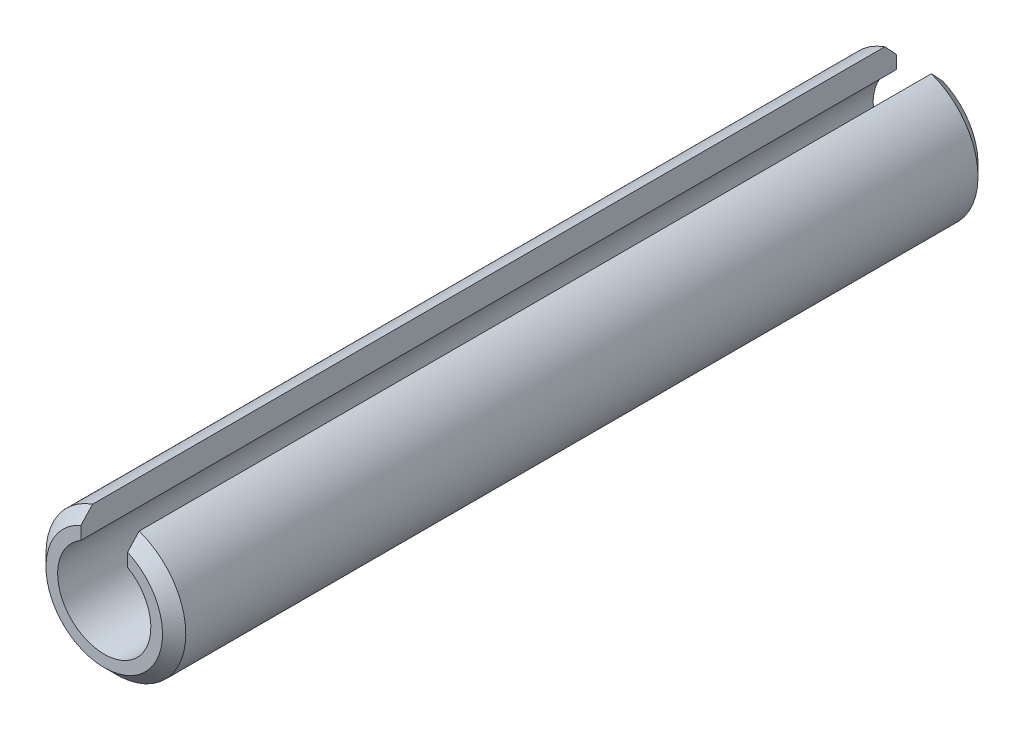
ISO-10303-21;
HEADER;
FILE_DESCRIPTION(('STEP AP214'),'2;1');
FILE_NAME('part.step','',(''),(''),'','','');
FILE_SCHEMA(('AUTOMOTIVE_DESIGN { 1 0 10303 214 1 1 1 1 }'));
ENDSEC;
DATA;
#1=APPLICATION_CONTEXT('core data for automotive mechanical design processes');
#2=APPLICATION_PROTOCOL_DEFINITION('international standard','automotive_design',2000,#1);
#3=PRODUCT_CONTEXT('',#1,'mechanical');
#4=PRODUCT('Part','Part','',(#3));
#5=PRODUCT_RELATED_PRODUCT_CATEGORY('part','',(#4));
#6=PRODUCT_DEFINITION_FORMATION('','',#4);
#7=PRODUCT_DEFINITION_CONTEXT('part definition',#1,'design');
#8=PRODUCT_DEFINITION('design','',#6,#7);
#9=PRODUCT_DEFINITION_SHAPE('','',#8);
#10=(LENGTH_UNIT() NAMED_UNIT(*) SI_UNIT(.MILLI.,.METRE.));
#11=(NAMED_UNIT(*) PLANE_ANGLE_UNIT() SI_UNIT($,.RADIAN.));
#12=(NAMED_UNIT(*) SI_UNIT($,.STERADIAN.) SOLID_ANGLE_UNIT());
#13=UNCERTAINTY_MEASURE_WITH_UNIT(LENGTH_MEASURE(1.E-05),#10,'distance_accuracy_value','');
#14=(GEOMETRIC_REPRESENTATION_CONTEXT(3) GLOBAL_UNCERTAINTY_ASSIGNED_CONTEXT((#13)) GLOBAL_UNIT_ASSIGNED_CONTEXT((#10,
#11,#12)) REPRESENTATION_CONTEXT('',''));
#15=CARTESIAN_POINT('',(0.,0.,0.));
#16=DIRECTION('',(0.,0.,1.));
#17=DIRECTION('',(1.,0.,0.));
#18=AXIS2_PLACEMENT_3D('',#15,#16,#17);
#19=CARTESIAN_POINT('',(0.,0.,35.));
#20=DIRECTION('',(0.,0.,-1.));
#21=DIRECTION('',(-1.,0.,0.));
#22=AXIS2_PLACEMENT_3D('',#19,#20,#21);
#23=CYLINDRICAL_SURFACE('',#22,3.);
#24=DIRECTION('',(0.,0.,-1.));
#25=VECTOR('',#24,1.);
#26=CARTESIAN_POINT('',(-0.999999999999997,2.82842712474619,35.));
#27=LINE('',#26,#25);
#28=CARTESIAN_POINT('',(-0.999999999999997,2.82842712474619,34.5));
#29=VERTEX_POINT('',#28);
#30=CARTESIAN_POINT('',(-0.999999999999997,2.82842712474619,0.5));
#31=VERTEX_POINT('',#30);
#32=EDGE_CURVE('E114',#29,#31,#27,.T.);
#33=ORIENTED_EDGE('',*,*,#32,.T.);
#34=CARTESIAN_POINT('',(0.,0.,0.5));
#35=DIRECTION('',(0.,0.,1.));
#36=DIRECTION('',(1.,0.,0.));
#37=AXIS2_PLACEMENT_3D('',#34,#35,#36);
#38=CIRCLE('',#37,3.);
#39=CARTESIAN_POINT('',(1.,2.82842712474619,0.500000000000001));
#40=VERTEX_POINT('',#39);
#41=EDGE_CURVE('E121',#31,#40,#38,.T.);
#42=ORIENTED_EDGE('',*,*,#41,.T.);
#43=DIRECTION('',(0.,0.,-1.));
#44=VECTOR('',#43,1.);
#45=CARTESIAN_POINT('',(1.,2.82842712474619,35.));
#46=LINE('',#45,#44);
#47=CARTESIAN_POINT('',(1.,2.82842712474619,34.5));
#48=VERTEX_POINT('',#47);
#49=EDGE_CURVE('E101',#48,#40,#46,.T.);
#50=ORIENTED_EDGE('',*,*,#49,.F.);
#51=CARTESIAN_POINT('',(0.,0.,34.5));
#52=DIRECTION('',(0.,0.,1.));
#53=DIRECTION('',(1.,0.,0.));
#54=AXIS2_PLACEMENT_3D('',#51,#52,#53);
#55=CIRCLE('',#54,3.);
#56=EDGE_CURVE('E119',#48,#29,#55,.F.);
#57=ORIENTED_EDGE('',*,*,#56,.T.);
#58=EDGE_LOOP('',(#33,#42,#50,#57));
#59=FACE_BOUND('',#58,.T.);
#60=ADVANCED_FACE('F30',(#59),#23,.T.);
#61=CARTESIAN_POINT('',(1.,2.82842712474619,35.));
#62=DIRECTION('',(1.,0.,0.));
#63=DIRECTION('',(0.,0.,-1.));
#64=AXIS2_PLACEMENT_3D('',#61,#62,#63);
#65=PLANE('',#64);
#66=ORIENTED_EDGE('',*,*,#49,.T.);
#67=CARTESIAN_POINT('',(1.,2.82842712474619,0.5));
#68=CARTESIAN_POINT('',(1.,2.78393060243607,0.458049299682896));
#69=CARTESIAN_POINT('',(1.,2.73938013855693,0.416155705079881));
#70=CARTESIAN_POINT('',(1.,2.65015403367117,0.332503146617472));
#71=CARTESIAN_POINT('',(1.,2.60547839420257,0.29074418111735));
#72=CARTESIAN_POINT('',(1.,2.51598341720938,0.207380143208967));
#73=CARTESIAN_POINT('',(1.,2.47116407923848,0.165775071279564));
#74=CARTESIAN_POINT('',(1.,2.38135760243373,0.0827453555177404));
#75=CARTESIAN_POINT('',(1.,2.33637046155039,0.0413207139025472));
#76=CARTESIAN_POINT('',(1.,2.29128784747792,0.));
#77=B_SPLINE_CURVE_WITH_KNOTS('',3,(#67,#68,#69,#70,#71,#72,#73,#74,#75,#76),.UNSPECIFIED.,.F.,
.F.,(4,2,2,2,4),(0.,0.183461811793637,0.366921379215902,0.550381517014302,0.733843902947407),.UNSPECIFIED.);
#78=CARTESIAN_POINT('',(1.,2.29128784747792,0.));
#79=VERTEX_POINT('',#78);
#80=EDGE_CURVE('E92',#40,#79,#77,.T.);
#81=ORIENTED_EDGE('',*,*,#80,.T.);
#82=DIRECTION('',(0.,-1.,0.));
#83=VECTOR('',#82,1.);
#84=CARTESIAN_POINT('',(1.,2.82842712474619,0.));
#85=LINE('',#84,#83);
#86=CARTESIAN_POINT('',(1.,1.73205080756888,0.));
#87=VERTEX_POINT('',#86);
#88=EDGE_CURVE('E85',#79,#87,#85,.T.);
#89=ORIENTED_EDGE('',*,*,#88,.T.);
#90=DIRECTION('',(0.,0.,-1.));
#91=VECTOR('',#90,1.);
#92=CARTESIAN_POINT('',(1.,1.73205080756888,35.));
#93=LINE('',#92,#91);
#94=CARTESIAN_POINT('',(1.,1.73205080756888,35.));
#95=VERTEX_POINT('',#94);
#96=EDGE_CURVE('E90',#95,#87,#93,.T.);
#97=ORIENTED_EDGE('',*,*,#96,.F.);
#98=DIRECTION('',(0.,-1.,0.));
#99=VECTOR('',#98,1.);
#100=CARTESIAN_POINT('',(1.,2.82842712474619,35.));
#101=LINE('',#100,#99);
#102=CARTESIAN_POINT('',(1.,2.29128784747792,35.));
#103=VERTEX_POINT('',#102);
#104=EDGE_CURVE('E107',#103,#95,#101,.T.);
#105=ORIENTED_EDGE('',*,*,#104,.F.);
#106=CARTESIAN_POINT('',(1.,2.29128784747792,35.));
#107=CARTESIAN_POINT('',(1.,2.33637046155038,34.9586792860974));
#108=CARTESIAN_POINT('',(1.,2.38135760243373,34.9172546444823));
#109=CARTESIAN_POINT('',(1.,2.47116407923848,34.8342249287204));
#110=CARTESIAN_POINT('',(1.,2.51598341720938,34.792619856791));
#111=CARTESIAN_POINT('',(1.,2.60547839420257,34.7092558188827));
#112=CARTESIAN_POINT('',(1.,2.65015403367117,34.6674968533825));
#113=CARTESIAN_POINT('',(1.,2.73938013855693,34.5838442949201));
#114=CARTESIAN_POINT('',(1.,2.78393060243607,34.5419507003171));
#115=CARTESIAN_POINT('',(1.,2.82842712474619,34.5));
#116=B_SPLINE_CURVE_WITH_KNOTS('',3,(#106,#107,#108,#109,#110,#111,#112,#113,#114,#115),
.UNSPECIFIED.,.F.,.F.,(4,2,2,2,4),(0.,0.183462385933106,0.366922523731505,0.550382091153768,
0.733843902947405),.UNSPECIFIED.);
#117=EDGE_CURVE('E124',#103,#48,#116,.T.);
#118=ORIENTED_EDGE('',*,*,#117,.T.);
#119=EDGE_LOOP('',(#66,#81,#89,#97,#105,#118));
#120=FACE_BOUND('',#119,.T.);
#121=ADVANCED_FACE('F88',(#120),#65,.F.);
#122=CARTESIAN_POINT('',(0.,0.,35.));
#123=DIRECTION('',(0.,0.,-1.));
#124=DIRECTION('',(-1.,0.,0.));
#125=AXIS2_PLACEMENT_3D('',#122,#123,#124);
#126=CYLINDRICAL_SURFACE('',#125,2.);
#127=CARTESIAN_POINT('',(0.,0.,0.));
#128=DIRECTION('',(0.,0.,-1.));
#129=DIRECTION('',(1.,0.,0.));
#130=AXIS2_PLACEMENT_3D('',#127,#128,#129);
#131=CIRCLE('',#130,2.);
#132=CARTESIAN_POINT('',(-0.999999999999998,1.73205080756888,0.));
#133=VERTEX_POINT('',#132);
#134=EDGE_CURVE('E94',#87,#133,#131,.T.);
#135=ORIENTED_EDGE('',*,*,#134,.T.);
#136=DIRECTION('',(0.,0.,-1.));
#137=VECTOR('',#136,1.);
#138=CARTESIAN_POINT('',(-0.999999999999998,1.73205080756888,35.));
#139=LINE('',#138,#137);
#140=CARTESIAN_POINT('',(-0.999999999999998,1.73205080756888,35.));
#141=VERTEX_POINT('',#140);
#142=EDGE_CURVE('E102',#141,#133,#139,.T.);
#143=ORIENTED_EDGE('',*,*,#142,.F.);
#144=CARTESIAN_POINT('',(0.,0.,35.));
#145=DIRECTION('',(0.,0.,-1.));
#146=DIRECTION('',(1.,0.,0.));
#147=AXIS2_PLACEMENT_3D('',#144,#145,#146);
#148=CIRCLE('',#147,2.);
#149=EDGE_CURVE('E100',#95,#141,#148,.T.);
#150=ORIENTED_EDGE('',*,*,#149,.F.);
#151=ORIENTED_EDGE('',*,*,#96,.T.);
#152=EDGE_LOOP('',(#135,#143,#150,#151));
#153=FACE_BOUND('',#152,.T.);
#154=ADVANCED_FACE('F97',(#153),#126,.F.);
#155=CARTESIAN_POINT('',(-0.999999999999997,2.82842712474619,35.));
#156=DIRECTION('',(-1.,0.,0.));
#157=DIRECTION('',(0.,0.,1.));
#158=AXIS2_PLACEMENT_3D('',#155,#156,#157);
#159=PLANE('',#158);
#160=DIRECTION('',(0.,1.,0.));
#161=VECTOR('',#160,1.);
#162=CARTESIAN_POINT('',(-0.999999999999997,2.82842712474619,0.));
#163=LINE('',#162,#161);
#164=CARTESIAN_POINT('',(-0.999999999999997,2.29128784747792,0.));
#165=VERTEX_POINT('',#164);
#166=EDGE_CURVE('E105',#133,#165,#163,.T.);
#167=ORIENTED_EDGE('',*,*,#166,.T.);
#168=CARTESIAN_POINT('',(-0.999999999999997,2.29128784747792,0.));
#169=CARTESIAN_POINT('',(-0.999999999999997,2.33637046155039,0.0413207139025474));
#170=CARTESIAN_POINT('',(-0.999999999999997,2.38135760243374,0.0827453555177403));
#171=CARTESIAN_POINT('',(-0.999999999999997,2.47116407923848,0.165775071279564));
#172=CARTESIAN_POINT('',(-0.999999999999997,2.51598341720939,0.207380143208967));
#173=CARTESIAN_POINT('',(-0.999999999999997,2.60547839420257,0.29074418111735));
#174=CARTESIAN_POINT('',(-0.999999999999997,2.65015403367117,0.332503146617472));
#175=CARTESIAN_POINT('',(-0.999999999999997,2.73938013855693,0.416155705079881));
#176=CARTESIAN_POINT('',(-0.999999999999997,2.78393060243607,0.458049299682896));
#177=CARTESIAN_POINT('',(-0.999999999999997,2.82842712474619,0.5));
#178=B_SPLINE_CURVE_WITH_KNOTS('',3,(#168,#169,#170,#171,#172,#173,#174,#175,#176,#177),
.UNSPECIFIED.,.F.,.F.,(4,2,2,2,4),(0.,0.183462385933105,0.366922523731505,0.55038209115377,
0.733843902947406),.UNSPECIFIED.);
#179=EDGE_CURVE('E37',#165,#31,#178,.T.);
#180=ORIENTED_EDGE('',*,*,#179,.T.);
#181=ORIENTED_EDGE('',*,*,#32,.F.);
#182=CARTESIAN_POINT('',(-0.999999999999998,2.82842712474619,34.5));
#183=CARTESIAN_POINT('',(-0.999999999999997,2.78393060243607,34.5419507003171));
#184=CARTESIAN_POINT('',(-0.999999999999997,2.73938013855693,34.5838442949201));
#185=CARTESIAN_POINT('',(-0.999999999999997,2.65015403367117,34.6674968533825));
#186=CARTESIAN_POINT('',(-0.999999999999997,2.60547839420257,34.7092558188827));
#187=CARTESIAN_POINT('',(-0.999999999999997,2.51598341720939,34.792619856791));
#188=CARTESIAN_POINT('',(-0.999999999999997,2.47116407923848,34.8342249287204));
#189=CARTESIAN_POINT('',(-0.999999999999997,2.38135760243374,34.9172546444823));
#190=CARTESIAN_POINT('',(-0.999999999999997,2.33637046155039,34.9586792860974));
#191=CARTESIAN_POINT('',(-0.999999999999997,2.29128784747792,35.));
#192=B_SPLINE_CURVE_WITH_KNOTS('',3,(#182,#183,#184,#185,#186,#187,#188,#189,#190,#191),
.UNSPECIFIED.,.F.,.F.,(4,2,2,2,4),(0.,0.183461811793637,0.366921379215902,0.5503815170143,
0.733843902947406),.UNSPECIFIED.);
#193=CARTESIAN_POINT('',(-0.999999999999997,2.29128784747792,35.));
#194=VERTEX_POINT('',#193);
#195=EDGE_CURVE('E44',#29,#194,#192,.T.);
#196=ORIENTED_EDGE('',*,*,#195,.T.);
#197=DIRECTION('',(0.,1.,0.));
#198=VECTOR('',#197,1.);
#199=CARTESIAN_POINT('',(-0.999999999999997,2.82842712474619,35.));
#200=LINE('',#199,#198);
#201=EDGE_CURVE('E112',#141,#194,#200,.T.);
#202=ORIENTED_EDGE('',*,*,#201,.F.);
#203=ORIENTED_EDGE('',*,*,#142,.T.);
#204=EDGE_LOOP('',(#167,#180,#181,#196,#202,#203));
#205=FACE_BOUND('',#204,.T.);
#206=ADVANCED_FACE('F143',(#205),#159,.F.);
#207=CARTESIAN_POINT('',(0.,0.,35.));
#208=DIRECTION('',(0.,0.,1.));
#209=DIRECTION('',(1.,0.,0.));
#210=AXIS2_PLACEMENT_3D('',#207,#208,#209);
#211=PLANE('',#210);
#212=ORIENTED_EDGE('',*,*,#201,.T.);
#213=CARTESIAN_POINT('',(0.,0.,35.));
#214=DIRECTION('',(0.,0.,1.));
#215=DIRECTION('',(1.,0.,0.));
#216=AXIS2_PLACEMENT_3D('',#213,#214,#215);
#217=CIRCLE('',#216,2.5);
#218=EDGE_CURVE('E11',#194,#103,#217,.T.);
#219=ORIENTED_EDGE('',*,*,#218,.T.);
#220=ORIENTED_EDGE('',*,*,#104,.T.);
#221=ORIENTED_EDGE('',*,*,#149,.T.);
#222=EDGE_LOOP('',(#212,#219,#220,#221));
#223=FACE_BOUND('',#222,.T.);
#224=ADVANCED_FACE('F147',(#223),#211,.T.);
#225=CARTESIAN_POINT('',(0.,0.,0.));
#226=DIRECTION('',(0.,0.,1.));
#227=DIRECTION('',(1.,0.,0.));
#228=AXIS2_PLACEMENT_3D('',#225,#226,#227);
#229=PLANE('',#228);
#230=ORIENTED_EDGE('',*,*,#88,.F.);
#231=CARTESIAN_POINT('',(0.,0.,0.));
#232=DIRECTION('',(0.,0.,1.));
#233=DIRECTION('',(1.,0.,0.));
#234=AXIS2_PLACEMENT_3D('',#231,#232,#233);
#235=CIRCLE('',#234,2.5);
#236=EDGE_CURVE('E52',#79,#165,#235,.F.);
#237=ORIENTED_EDGE('',*,*,#236,.T.);
#238=ORIENTED_EDGE('',*,*,#166,.F.);
#239=ORIENTED_EDGE('',*,*,#134,.F.);
#240=EDGE_LOOP('',(#230,#237,#238,#239));
#241=FACE_BOUND('',#240,.T.);
#242=ADVANCED_FACE('F104',(#241),#229,.F.);
#243=CARTESIAN_POINT('',(0.,0.,0.5));
#244=DIRECTION('',(0.,0.,1.));
#245=DIRECTION('',(1.,0.,0.));
#246=AXIS2_PLACEMENT_3D('',#243,#244,#245);
#247=CONICAL_SURFACE('',#246,3.,0.785398163397449);
#248=ORIENTED_EDGE('',*,*,#179,.F.);
#249=ORIENTED_EDGE('',*,*,#236,.F.);
#250=ORIENTED_EDGE('',*,*,#80,.F.);
#251=ORIENTED_EDGE('',*,*,#41,.F.);
#252=EDGE_LOOP('',(#248,#249,#250,#251));
#253=FACE_BOUND('',#252,.T.);
#254=ADVANCED_FACE('F157',(#253),#247,.T.);
#255=CARTESIAN_POINT('',(0.,0.,35.));
#256=DIRECTION('',(0.,0.,-1.));
#257=DIRECTION('',(-1.,0.,0.));
#258=AXIS2_PLACEMENT_3D('',#255,#256,#257);
#259=CONICAL_SURFACE('',#258,2.5,0.785398163397448);
#260=ORIENTED_EDGE('',*,*,#195,.F.);
#261=ORIENTED_EDGE('',*,*,#56,.F.);
#262=ORIENTED_EDGE('',*,*,#117,.F.);
#263=ORIENTED_EDGE('',*,*,#218,.F.);
#264=EDGE_LOOP('',(#260,#261,#262,#263));
#265=FACE_BOUND('',#264,.T.);
#266=ADVANCED_FACE('F135',(#265),#259,.T.);
#267=CLOSED_SHELL('',(#60,#121,#154,#206,#224,#242,#254,#266));
#268=MANIFOLD_SOLID_BREP('B2',#267);
#269=ADVANCED_BREP_SHAPE_REPRESENTATION('',(#18,#268),#14);
#270=SHAPE_DEFINITION_REPRESENTATION(#9,#269);
ENDSEC;
END-ISO-10303-21;
